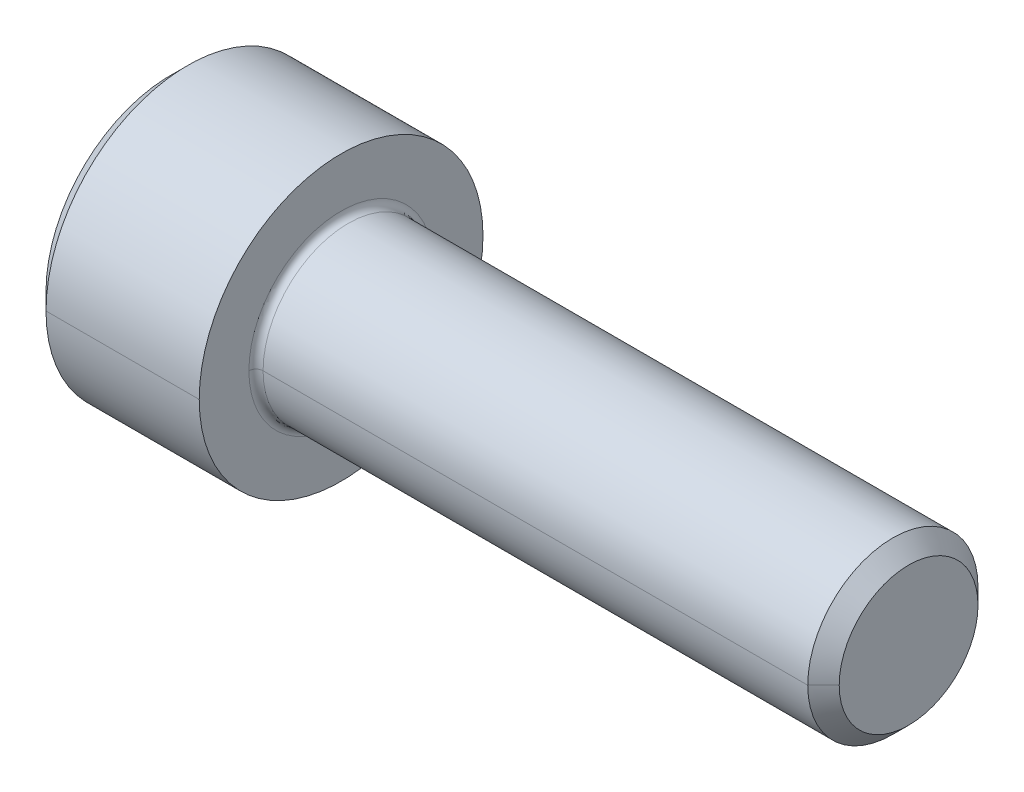
ISO-10303-21;
HEADER;
FILE_DESCRIPTION(('STEP AP214'),'2;1');
FILE_NAME('part.step','',(''),(''),'','','');
FILE_SCHEMA(('AUTOMOTIVE_DESIGN { 1 0 10303 214 1 1 1 1 }'));
ENDSEC;
DATA;
#1=APPLICATION_CONTEXT('core data for automotive mechanical design processes');
#2=APPLICATION_PROTOCOL_DEFINITION('international standard','automotive_design',2000,#1);
#3=PRODUCT_CONTEXT('',#1,'mechanical');
#4=PRODUCT('Part','Part','',(#3));
#5=PRODUCT_RELATED_PRODUCT_CATEGORY('part','',(#4));
#6=PRODUCT_DEFINITION_FORMATION('','',#4);
#7=PRODUCT_DEFINITION_CONTEXT('part definition',#1,'design');
#8=PRODUCT_DEFINITION('design','',#6,#7);
#9=PRODUCT_DEFINITION_SHAPE('','',#8);
#10=(LENGTH_UNIT() NAMED_UNIT(*) SI_UNIT(.MILLI.,.METRE.));
#11=(NAMED_UNIT(*) PLANE_ANGLE_UNIT() SI_UNIT($,.RADIAN.));
#12=(NAMED_UNIT(*) SI_UNIT($,.STERADIAN.) SOLID_ANGLE_UNIT());
#13=UNCERTAINTY_MEASURE_WITH_UNIT(LENGTH_MEASURE(1.E-05),#10,'distance_accuracy_value','');
#14=(GEOMETRIC_REPRESENTATION_CONTEXT(3) GLOBAL_UNCERTAINTY_ASSIGNED_CONTEXT((#13)) GLOBAL_UNIT_ASSIGNED_CONTEXT((#10,
#11,#12)) REPRESENTATION_CONTEXT('',''));
#15=CARTESIAN_POINT('',(0.,0.,0.));
#16=DIRECTION('',(0.,0.,1.));
#17=DIRECTION('',(1.,0.,0.));
#18=AXIS2_PLACEMENT_3D('',#15,#16,#17);
#19=CARTESIAN_POINT('',(3.,0.,0.));
#20=DIRECTION('',(-1.,0.,0.));
#21=DIRECTION('',(0.,0.,1.));
#22=AXIS2_PLACEMENT_3D('',#19,#20,#21);
#23=CONICAL_SURFACE('',#22,2.542,1.0471975511966);
#24=DIRECTION('',(-0.5,0.,-0.866025403784437));
#25=VECTOR('',#24,1.);
#26=CARTESIAN_POINT('',(3.,0.,-2.542));
#27=LINE('',#26,#25);
#28=CARTESIAN_POINT('',(4.46762438428004,0.,0.));
#29=VERTEX_POINT('',#28);
#30=CARTESIAN_POINT('',(3.,0.,-2.542));
#31=VERTEX_POINT('',#30);
#32=EDGE_CURVE('E388',#29,#31,#27,.T.);
#33=ORIENTED_EDGE('',*,*,#32,.F.);
#34=DIRECTION('',(-0.5,0.,0.866025403784437));
#35=VECTOR('',#34,1.);
#36=CARTESIAN_POINT('',(3.,0.,2.542));
#37=LINE('',#36,#35);
#38=CARTESIAN_POINT('',(3.,0.,2.542));
#39=VERTEX_POINT('',#38);
#40=EDGE_CURVE('E385',#29,#39,#37,.T.);
#41=ORIENTED_EDGE('',*,*,#40,.T.);
#42=CARTESIAN_POINT('',(3.,0.,0.));
#43=DIRECTION('',(-1.,0.,0.));
#44=DIRECTION('',(0.,0.,1.));
#45=AXIS2_PLACEMENT_3D('',#42,#43,#44);
#46=CIRCLE('',#45,2.542);
#47=CARTESIAN_POINT('',(3.,2.20143657642004,1.271));
#48=VERTEX_POINT('',#47);
#49=EDGE_CURVE('E356',#39,#48,#46,.T.);
#50=ORIENTED_EDGE('',*,*,#49,.T.);
#51=CARTESIAN_POINT('',(3.,0.,0.));
#52=DIRECTION('',(-1.,0.,0.));
#53=DIRECTION('',(0.,0.,1.));
#54=AXIS2_PLACEMENT_3D('',#51,#52,#53);
#55=CIRCLE('',#54,2.542);
#56=CARTESIAN_POINT('',(3.,2.20143657642004,-1.271));
#57=VERTEX_POINT('',#56);
#58=EDGE_CURVE('E18',#48,#57,#55,.T.);
#59=ORIENTED_EDGE('',*,*,#58,.T.);
#60=CARTESIAN_POINT('',(3.,0.,0.));
#61=DIRECTION('',(-1.,0.,0.));
#62=DIRECTION('',(0.,0.,1.));
#63=AXIS2_PLACEMENT_3D('',#60,#61,#62);
#64=CIRCLE('',#63,2.542);
#65=EDGE_CURVE('E9',#57,#31,#64,.T.);
#66=ORIENTED_EDGE('',*,*,#65,.T.);
#67=EDGE_LOOP('',(#33,#41,#50,#59,#66));
#68=FACE_BOUND('',#67,.T.);
#69=ADVANCED_FACE('F14',(#68),#23,.F.);
#70=CARTESIAN_POINT('',(3.,4.40287315284008,-2.542));
#71=DIRECTION('',(1.,0.,0.));
#72=DIRECTION('',(0.,1.,0.));
#73=AXIS2_PLACEMENT_3D('',#70,#71,#72);
#74=PLANE('',#73);
#75=DIRECTION('',(0.,-0.5,-0.866025403784438));
#76=VECTOR('',#75,1.);
#77=CARTESIAN_POINT('',(3.,2.93524876856006,0.));
#78=LINE('',#77,#76);
#79=CARTESIAN_POINT('',(3.,1.46762438428002,-2.542));
#80=VERTEX_POINT('',#79);
#81=EDGE_CURVE('E42',#57,#80,#78,.T.);
#82=ORIENTED_EDGE('',*,*,#81,.T.);
#83=DIRECTION('',(0.,-1.,0.));
#84=VECTOR('',#83,1.);
#85=CARTESIAN_POINT('',(3.,1.46762438428002,-2.542));
#86=LINE('',#85,#84);
#87=EDGE_CURVE('E347',#80,#31,#86,.T.);
#88=ORIENTED_EDGE('',*,*,#87,.T.);
#89=ORIENTED_EDGE('',*,*,#65,.F.);
#90=EDGE_LOOP('',(#82,#88,#89));
#91=FACE_BOUND('',#90,.T.);
#92=ADVANCED_FACE('F471',(#91),#74,.F.);
#93=CARTESIAN_POINT('',(3.,4.40287315284008,-2.542));
#94=DIRECTION('',(1.,0.,0.));
#95=DIRECTION('',(0.,1.,0.));
#96=AXIS2_PLACEMENT_3D('',#93,#94,#95);
#97=PLANE('',#96);
#98=DIRECTION('',(0.,-0.5,0.866025403784439));
#99=VECTOR('',#98,1.);
#100=CARTESIAN_POINT('',(3.,2.93524876856006,0.));
#101=LINE('',#100,#99);
#102=CARTESIAN_POINT('',(3.,2.93524876856006,0.));
#103=VERTEX_POINT('',#102);
#104=EDGE_CURVE('E317',#103,#48,#101,.T.);
#105=ORIENTED_EDGE('',*,*,#104,.F.);
#106=DIRECTION('',(0.,-0.5,-0.866025403784438));
#107=VECTOR('',#106,1.);
#108=CARTESIAN_POINT('',(3.,2.93524876856006,0.));
#109=LINE('',#108,#107);
#110=EDGE_CURVE('E353',#103,#57,#109,.T.);
#111=ORIENTED_EDGE('',*,*,#110,.T.);
#112=ORIENTED_EDGE('',*,*,#58,.F.);
#113=EDGE_LOOP('',(#105,#111,#112));
#114=FACE_BOUND('',#113,.T.);
#115=ADVANCED_FACE('F16',(#114),#97,.F.);
#116=CARTESIAN_POINT('',(3.,4.40287315284008,-2.542));
#117=DIRECTION('',(1.,0.,0.));
#118=DIRECTION('',(0.,1.,0.));
#119=AXIS2_PLACEMENT_3D('',#116,#117,#118);
#120=PLANE('',#119);
#121=DIRECTION('',(0.,1.,0.));
#122=VECTOR('',#121,1.);
#123=CARTESIAN_POINT('',(3.,-1.46762438428003,2.542));
#124=LINE('',#123,#122);
#125=CARTESIAN_POINT('',(3.,1.46762438428003,2.542));
#126=VERTEX_POINT('',#125);
#127=EDGE_CURVE('E328',#39,#126,#124,.T.);
#128=ORIENTED_EDGE('',*,*,#127,.T.);
#129=DIRECTION('',(0.,-0.5,0.866025403784439));
#130=VECTOR('',#129,1.);
#131=CARTESIAN_POINT('',(3.,2.93524876856006,0.));
#132=LINE('',#131,#130);
#133=EDGE_CURVE('E321',#48,#126,#132,.T.);
#134=ORIENTED_EDGE('',*,*,#133,.F.);
#135=ORIENTED_EDGE('',*,*,#49,.F.);
#136=EDGE_LOOP('',(#128,#134,#135));
#137=FACE_BOUND('',#136,.T.);
#138=ADVANCED_FACE('F426',(#137),#120,.F.);
#139=CARTESIAN_POINT('',(3.,4.40287315284008,-2.542));
#140=DIRECTION('',(1.,0.,0.));
#141=DIRECTION('',(0.,1.,0.));
#142=AXIS2_PLACEMENT_3D('',#139,#140,#141);
#143=PLANE('',#142);
#144=DIRECTION('',(0.,-0.5,-0.866025403784438));
#145=VECTOR('',#144,1.);
#146=CARTESIAN_POINT('',(3.,-1.46762438428003,2.542));
#147=LINE('',#146,#145);
#148=CARTESIAN_POINT('',(3.,-1.46762438428003,2.542));
#149=VERTEX_POINT('',#148);
#150=CARTESIAN_POINT('',(3.,-2.20143657642005,1.271));
#151=VERTEX_POINT('',#150);
#152=EDGE_CURVE('E232',#149,#151,#147,.T.);
#153=ORIENTED_EDGE('',*,*,#152,.F.);
#154=DIRECTION('',(0.,1.,0.));
#155=VECTOR('',#154,1.);
#156=CARTESIAN_POINT('',(3.,-1.46762438428003,2.542));
#157=LINE('',#156,#155);
#158=EDGE_CURVE('E331',#149,#39,#157,.T.);
#159=ORIENTED_EDGE('',*,*,#158,.T.);
#160=CARTESIAN_POINT('',(3.,0.,0.));
#161=DIRECTION('',(-1.,0.,0.));
#162=DIRECTION('',(0.,0.,1.));
#163=AXIS2_PLACEMENT_3D('',#160,#161,#162);
#164=CIRCLE('',#163,2.542);
#165=EDGE_CURVE('E200',#151,#39,#164,.T.);
#166=ORIENTED_EDGE('',*,*,#165,.F.);
#167=EDGE_LOOP('',(#153,#159,#166));
#168=FACE_BOUND('',#167,.T.);
#169=ADVANCED_FACE('F420',(#168),#143,.F.);
#170=CARTESIAN_POINT('',(3.,4.40287315284008,-2.542));
#171=DIRECTION('',(1.,0.,0.));
#172=DIRECTION('',(0.,1.,0.));
#173=AXIS2_PLACEMENT_3D('',#170,#171,#172);
#174=PLANE('',#173);
#175=DIRECTION('',(0.,0.5,-0.86602540378444));
#176=VECTOR('',#175,1.);
#177=CARTESIAN_POINT('',(3.,-2.93524876856006,0.));
#178=LINE('',#177,#176);
#179=CARTESIAN_POINT('',(3.,-2.93524876856006,0.));
#180=VERTEX_POINT('',#179);
#181=CARTESIAN_POINT('',(3.,-2.20143657642005,-1.271));
#182=VERTEX_POINT('',#181);
#183=EDGE_CURVE('E306',#180,#182,#178,.T.);
#184=ORIENTED_EDGE('',*,*,#183,.F.);
#185=DIRECTION('',(0.,-0.5,-0.866025403784438));
#186=VECTOR('',#185,1.);
#187=CARTESIAN_POINT('',(3.,-1.46762438428003,2.542));
#188=LINE('',#187,#186);
#189=EDGE_CURVE('E236',#151,#180,#188,.T.);
#190=ORIENTED_EDGE('',*,*,#189,.F.);
#191=CARTESIAN_POINT('',(3.,0.,0.));
#192=DIRECTION('',(-1.,0.,0.));
#193=DIRECTION('',(0.,0.,1.));
#194=AXIS2_PLACEMENT_3D('',#191,#192,#193);
#195=CIRCLE('',#194,2.542);
#196=EDGE_CURVE('E209',#182,#151,#195,.T.);
#197=ORIENTED_EDGE('',*,*,#196,.F.);
#198=EDGE_LOOP('',(#184,#190,#197));
#199=FACE_BOUND('',#198,.T.);
#200=ADVANCED_FACE('F412',(#199),#174,.F.);
#201=CARTESIAN_POINT('',(3.,4.40287315284008,-2.542));
#202=DIRECTION('',(1.,0.,0.));
#203=DIRECTION('',(0.,1.,0.));
#204=AXIS2_PLACEMENT_3D('',#201,#202,#203);
#205=PLANE('',#204);
#206=DIRECTION('',(0.,-1.,0.));
#207=VECTOR('',#206,1.);
#208=CARTESIAN_POINT('',(3.,1.46762438428002,-2.542));
#209=LINE('',#208,#207);
#210=CARTESIAN_POINT('',(3.,-1.46762438428004,-2.542));
#211=VERTEX_POINT('',#210);
#212=EDGE_CURVE('E247',#31,#211,#209,.T.);
#213=ORIENTED_EDGE('',*,*,#212,.T.);
#214=DIRECTION('',(0.,0.5,-0.86602540378444));
#215=VECTOR('',#214,1.);
#216=CARTESIAN_POINT('',(3.,-2.93524876856006,0.));
#217=LINE('',#216,#215);
#218=EDGE_CURVE('E248',#182,#211,#217,.T.);
#219=ORIENTED_EDGE('',*,*,#218,.F.);
#220=CARTESIAN_POINT('',(3.,0.,0.));
#221=DIRECTION('',(-1.,0.,0.));
#222=DIRECTION('',(0.,0.,1.));
#223=AXIS2_PLACEMENT_3D('',#220,#221,#222);
#224=CIRCLE('',#223,2.542);
#225=EDGE_CURVE('E213',#31,#182,#224,.T.);
#226=ORIENTED_EDGE('',*,*,#225,.F.);
#227=EDGE_LOOP('',(#213,#219,#226));
#228=FACE_BOUND('',#227,.T.);
#229=ADVANCED_FACE('F406',(#228),#205,.F.);
#230=CARTESIAN_POINT('',(3.,2.93524876856006,0.));
#231=DIRECTION('',(0.,0.866025403784438,-0.5));
#232=DIRECTION('',(-1.,0.,0.));
#233=AXIS2_PLACEMENT_3D('',#230,#231,#232);
#234=PLANE('',#233);
#235=DIRECTION('',(0.,-0.5,-0.866025403784438));
#236=VECTOR('',#235,1.);
#237=CARTESIAN_POINT('',(0.,2.93524876856006,0.));
#238=LINE('',#237,#236);
#239=CARTESIAN_POINT('',(0.,2.93524876856006,0.));
#240=VERTEX_POINT('',#239);
#241=CARTESIAN_POINT('',(0.,1.46762438428002,-2.542));
#242=VERTEX_POINT('',#241);
#243=EDGE_CURVE('E223',#240,#242,#238,.T.);
#244=ORIENTED_EDGE('',*,*,#243,.T.);
#245=DIRECTION('',(-1.,0.,0.));
#246=VECTOR('',#245,1.);
#247=CARTESIAN_POINT('',(3.,1.46762438428002,-2.542));
#248=LINE('',#247,#246);
#249=EDGE_CURVE('E348',#80,#242,#248,.T.);
#250=ORIENTED_EDGE('',*,*,#249,.F.);
#251=ORIENTED_EDGE('',*,*,#81,.F.);
#252=ORIENTED_EDGE('',*,*,#110,.F.);
#253=DIRECTION('',(-1.,0.,0.));
#254=VECTOR('',#253,1.);
#255=CARTESIAN_POINT('',(3.,2.93524876856006,0.));
#256=LINE('',#255,#254);
#257=EDGE_CURVE('E207',#103,#240,#256,.T.);
#258=ORIENTED_EDGE('',*,*,#257,.T.);
#259=EDGE_LOOP('',(#244,#250,#251,#252,#258));
#260=FACE_BOUND('',#259,.T.);
#261=ADVANCED_FACE('F371',(#260),#234,.F.);
#262=CARTESIAN_POINT('',(3.,1.46762438428002,-2.542));
#263=DIRECTION('',(0.,0.,-1.));
#264=DIRECTION('',(0.,-1.,0.));
#265=AXIS2_PLACEMENT_3D('',#262,#263,#264);
#266=PLANE('',#265);
#267=DIRECTION('',(0.,-1.,0.));
#268=VECTOR('',#267,1.);
#269=CARTESIAN_POINT('',(0.,1.46762438428002,-2.542));
#270=LINE('',#269,#268);
#271=CARTESIAN_POINT('',(0.,-1.46762438428004,-2.542));
#272=VERTEX_POINT('',#271);
#273=EDGE_CURVE('E228',#242,#272,#270,.T.);
#274=ORIENTED_EDGE('',*,*,#273,.T.);
#275=DIRECTION('',(-1.,0.,0.));
#276=VECTOR('',#275,1.);
#277=CARTESIAN_POINT('',(3.,-1.46762438428004,-2.542));
#278=LINE('',#277,#276);
#279=EDGE_CURVE('E244',#211,#272,#278,.T.);
#280=ORIENTED_EDGE('',*,*,#279,.F.);
#281=ORIENTED_EDGE('',*,*,#212,.F.);
#282=ORIENTED_EDGE('',*,*,#87,.F.);
#283=ORIENTED_EDGE('',*,*,#249,.T.);
#284=EDGE_LOOP('',(#274,#280,#281,#282,#283));
#285=FACE_BOUND('',#284,.T.);
#286=ADVANCED_FACE('F377',(#285),#266,.F.);
#287=CARTESIAN_POINT('',(3.,-2.93524876856006,0.));
#288=DIRECTION('',(0.,0.86602540378444,0.5));
#289=DIRECTION('',(1.,0.,0.));
#290=AXIS2_PLACEMENT_3D('',#287,#288,#289);
#291=PLANE('',#290);
#292=DIRECTION('',(0.,0.5,-0.86602540378444));
#293=VECTOR('',#292,1.);
#294=CARTESIAN_POINT('',(0.,-2.93524876856006,0.));
#295=LINE('',#294,#293);
#296=CARTESIAN_POINT('',(0.,-2.93524876856006,0.));
#297=VERTEX_POINT('',#296);
#298=EDGE_CURVE('E299',#297,#272,#295,.T.);
#299=ORIENTED_EDGE('',*,*,#298,.F.);
#300=DIRECTION('',(-1.,0.,0.));
#301=VECTOR('',#300,1.);
#302=CARTESIAN_POINT('',(3.,-2.93524876856006,0.));
#303=LINE('',#302,#301);
#304=EDGE_CURVE('E310',#180,#297,#303,.T.);
#305=ORIENTED_EDGE('',*,*,#304,.F.);
#306=ORIENTED_EDGE('',*,*,#183,.T.);
#307=ORIENTED_EDGE('',*,*,#218,.T.);
#308=ORIENTED_EDGE('',*,*,#279,.T.);
#309=EDGE_LOOP('',(#299,#305,#306,#307,#308));
#310=FACE_BOUND('',#309,.T.);
#311=ADVANCED_FACE('F410',(#310),#291,.T.);
#312=CARTESIAN_POINT('',(3.,-1.46762438428003,2.542));
#313=DIRECTION('',(0.,0.866025403784438,-0.5));
#314=DIRECTION('',(-1.,0.,0.));
#315=AXIS2_PLACEMENT_3D('',#312,#313,#314);
#316=PLANE('',#315);
#317=DIRECTION('',(0.,-0.5,-0.866025403784438));
#318=VECTOR('',#317,1.);
#319=CARTESIAN_POINT('',(0.,-1.46762438428003,2.542));
#320=LINE('',#319,#318);
#321=CARTESIAN_POINT('',(0.,-1.46762438428003,2.542));
#322=VERTEX_POINT('',#321);
#323=EDGE_CURVE('E295',#322,#297,#320,.T.);
#324=ORIENTED_EDGE('',*,*,#323,.F.);
#325=DIRECTION('',(-1.,0.,0.));
#326=VECTOR('',#325,1.);
#327=CARTESIAN_POINT('',(3.,-1.46762438428003,2.542));
#328=LINE('',#327,#326);
#329=EDGE_CURVE('E237',#149,#322,#328,.T.);
#330=ORIENTED_EDGE('',*,*,#329,.F.);
#331=ORIENTED_EDGE('',*,*,#152,.T.);
#332=ORIENTED_EDGE('',*,*,#189,.T.);
#333=ORIENTED_EDGE('',*,*,#304,.T.);
#334=EDGE_LOOP('',(#324,#330,#331,#332,#333));
#335=FACE_BOUND('',#334,.T.);
#336=ADVANCED_FACE('F417',(#335),#316,.T.);
#337=CARTESIAN_POINT('',(3.,-1.46762438428003,2.542));
#338=DIRECTION('',(0.,0.,1.));
#339=DIRECTION('',(0.,-1.,0.));
#340=AXIS2_PLACEMENT_3D('',#337,#338,#339);
#341=PLANE('',#340);
#342=DIRECTION('',(0.,1.,0.));
#343=VECTOR('',#342,1.);
#344=CARTESIAN_POINT('',(0.,-1.46762438428003,2.542));
#345=LINE('',#344,#343);
#346=CARTESIAN_POINT('',(0.,1.46762438428003,2.542));
#347=VERTEX_POINT('',#346);
#348=EDGE_CURVE('E291',#322,#347,#345,.T.);
#349=ORIENTED_EDGE('',*,*,#348,.T.);
#350=DIRECTION('',(-1.,0.,0.));
#351=VECTOR('',#350,1.);
#352=CARTESIAN_POINT('',(3.,1.46762438428003,2.542));
#353=LINE('',#352,#351);
#354=EDGE_CURVE('E325',#126,#347,#353,.T.);
#355=ORIENTED_EDGE('',*,*,#354,.F.);
#356=ORIENTED_EDGE('',*,*,#127,.F.);
#357=ORIENTED_EDGE('',*,*,#158,.F.);
#358=ORIENTED_EDGE('',*,*,#329,.T.);
#359=EDGE_LOOP('',(#349,#355,#356,#357,#358));
#360=FACE_BOUND('',#359,.T.);
#361=ADVANCED_FACE('F424',(#360),#341,.F.);
#362=CARTESIAN_POINT('',(3.,2.93524876856006,0.));
#363=DIRECTION('',(0.,-0.866025403784439,-0.5));
#364=DIRECTION('',(0.,0.5,-0.866025403784439));
#365=AXIS2_PLACEMENT_3D('',#362,#363,#364);
#366=PLANE('',#365);
#367=DIRECTION('',(0.,-0.5,0.866025403784439));
#368=VECTOR('',#367,1.);
#369=CARTESIAN_POINT('',(0.,2.93524876856006,0.));
#370=LINE('',#369,#368);
#371=EDGE_CURVE('E287',#240,#347,#370,.T.);
#372=ORIENTED_EDGE('',*,*,#371,.F.);
#373=ORIENTED_EDGE('',*,*,#257,.F.);
#374=ORIENTED_EDGE('',*,*,#104,.T.);
#375=ORIENTED_EDGE('',*,*,#133,.T.);
#376=ORIENTED_EDGE('',*,*,#354,.T.);
#377=EDGE_LOOP('',(#372,#373,#374,#375,#376));
#378=FACE_BOUND('',#377,.T.);
#379=ADVANCED_FACE('F429',(#378),#366,.T.);
#380=CARTESIAN_POINT('',(6.25,0.,0.));
#381=DIRECTION('',(1.,0.,0.));
#382=DIRECTION('',(0.,0.,-1.));
#383=AXIS2_PLACEMENT_3D('',#380,#381,#382);
#384=TOROIDAL_SURFACE('',#383,3.25,0.25);
#385=CARTESIAN_POINT('',(6.25,0.,3.25));
#386=DIRECTION('',(0.,1.,0.));
#387=DIRECTION('',(0.,0.,1.));
#388=AXIS2_PLACEMENT_3D('',#385,#386,#387);
#389=CIRCLE('',#388,0.25);
#390=CARTESIAN_POINT('',(6.25,0.,3.));
#391=VERTEX_POINT('',#390);
#392=CARTESIAN_POINT('',(6.,0.,3.25));
#393=VERTEX_POINT('',#392);
#394=EDGE_CURVE('E175',#391,#393,#389,.T.);
#395=ORIENTED_EDGE('',*,*,#394,.F.);
#396=CARTESIAN_POINT('',(6.25,0.,0.));
#397=DIRECTION('',(1.,0.,0.));
#398=DIRECTION('',(0.,0.,-1.));
#399=AXIS2_PLACEMENT_3D('',#396,#397,#398);
#400=CIRCLE('',#399,3.);
#401=CARTESIAN_POINT('',(6.25,0.,-3.));
#402=VERTEX_POINT('',#401);
#403=EDGE_CURVE('E268',#402,#391,#400,.T.);
#404=ORIENTED_EDGE('',*,*,#403,.F.);
#405=CARTESIAN_POINT('',(6.25,0.,-3.25));
#406=DIRECTION('',(0.,-1.,0.));
#407=DIRECTION('',(0.,0.,-1.));
#408=AXIS2_PLACEMENT_3D('',#405,#406,#407);
#409=CIRCLE('',#408,0.25);
#410=CARTESIAN_POINT('',(6.,0.,-3.25));
#411=VERTEX_POINT('',#410);
#412=EDGE_CURVE('E178',#402,#411,#409,.T.);
#413=ORIENTED_EDGE('',*,*,#412,.T.);
#414=CARTESIAN_POINT('',(6.,0.,0.));
#415=DIRECTION('',(-1.,0.,0.));
#416=DIRECTION('',(0.,0.,-1.));
#417=AXIS2_PLACEMENT_3D('',#414,#415,#416);
#418=CIRCLE('',#417,3.25);
#419=EDGE_CURVE('E171',#393,#411,#418,.T.);
#420=ORIENTED_EDGE('',*,*,#419,.F.);
#421=EDGE_LOOP('',(#395,#404,#413,#420));
#422=FACE_BOUND('',#421,.T.);
#423=ADVANCED_FACE('F173',(#422),#384,.F.);
#424=CARTESIAN_POINT('',(0.,0.,0.));
#425=DIRECTION('',(1.,0.,0.));
#426=DIRECTION('',(0.,0.,-1.));
#427=AXIS2_PLACEMENT_3D('',#424,#425,#426);
#428=CONICAL_SURFACE('',#427,4.4,0.785398163397446);
#429=DIRECTION('',(0.707106781186549,0.,0.707106781186546));
#430=VECTOR('',#429,1.);
#431=CARTESIAN_POINT('',(0.,0.,4.4));
#432=LINE('',#431,#430);
#433=CARTESIAN_POINT('',(0.,0.,4.4));
#434=VERTEX_POINT('',#433);
#435=CARTESIAN_POINT('',(0.6,0.,5.));
#436=VERTEX_POINT('',#435);
#437=EDGE_CURVE('E204',#434,#436,#432,.T.);
#438=ORIENTED_EDGE('',*,*,#437,.F.);
#439=CARTESIAN_POINT('',(0.,0.,0.));
#440=DIRECTION('',(-1.,0.,0.));
#441=DIRECTION('',(0.,0.,1.));
#442=AXIS2_PLACEMENT_3D('',#439,#440,#441);
#443=CIRCLE('',#442,4.4);
#444=CARTESIAN_POINT('',(0.,0.,-4.4));
#445=VERTEX_POINT('',#444);
#446=EDGE_CURVE('E218',#445,#434,#443,.T.);
#447=ORIENTED_EDGE('',*,*,#446,.F.);
#448=DIRECTION('',(0.707106781186549,0.,-0.707106781186546));
#449=VECTOR('',#448,1.);
#450=CARTESIAN_POINT('',(0.,0.,-4.4));
#451=LINE('',#450,#449);
#452=CARTESIAN_POINT('',(0.6,0.,-5.));
#453=VERTEX_POINT('',#452);
#454=EDGE_CURVE('E238',#445,#453,#451,.T.);
#455=ORIENTED_EDGE('',*,*,#454,.T.);
#456=CARTESIAN_POINT('',(0.6,0.,0.));
#457=DIRECTION('',(-1.,0.,0.));
#458=DIRECTION('',(0.,0.,1.));
#459=AXIS2_PLACEMENT_3D('',#456,#457,#458);
#460=CIRCLE('',#459,5.);
#461=EDGE_CURVE('E182',#453,#436,#460,.T.);
#462=ORIENTED_EDGE('',*,*,#461,.T.);
#463=EDGE_LOOP('',(#438,#447,#455,#462));
#464=FACE_BOUND('',#463,.T.);
#465=ADVANCED_FACE('F443',(#464),#428,.T.);
#466=CARTESIAN_POINT('',(-31.75,0.,0.));
#467=DIRECTION('',(-1.,0.,0.));
#468=DIRECTION('',(0.,0.,1.));
#469=AXIS2_PLACEMENT_3D('',#466,#467,#468);
#470=CYLINDRICAL_SURFACE('',#469,5.);
#471=DIRECTION('',(-1.,0.,0.));
#472=VECTOR('',#471,1.);
#473=CARTESIAN_POINT('',(-31.75,0.,-5.));
#474=LINE('',#473,#472);
#475=CARTESIAN_POINT('',(6.,0.,-5.));
#476=VERTEX_POINT('',#475);
#477=EDGE_CURVE('E255',#476,#453,#474,.T.);
#478=ORIENTED_EDGE('',*,*,#477,.F.);
#479=CARTESIAN_POINT('',(6.,0.,0.));
#480=DIRECTION('',(-1.,0.,0.));
#481=DIRECTION('',(0.,0.,1.));
#482=AXIS2_PLACEMENT_3D('',#479,#480,#481);
#483=CIRCLE('',#482,5.);
#484=CARTESIAN_POINT('',(6.,0.,5.));
#485=VERTEX_POINT('',#484);
#486=EDGE_CURVE('E183',#476,#485,#483,.T.);
#487=ORIENTED_EDGE('',*,*,#486,.T.);
#488=DIRECTION('',(-1.,0.,0.));
#489=VECTOR('',#488,1.);
#490=CARTESIAN_POINT('',(-31.75,0.,5.));
#491=LINE('',#490,#489);
#492=EDGE_CURVE('E259',#485,#436,#491,.T.);
#493=ORIENTED_EDGE('',*,*,#492,.T.);
#494=ORIENTED_EDGE('',*,*,#461,.F.);
#495=EDGE_LOOP('',(#478,#487,#493,#494));
#496=FACE_BOUND('',#495,.T.);
#497=ADVANCED_FACE('F454',(#496),#470,.T.);
#498=CARTESIAN_POINT('',(6.,5.,0.));
#499=DIRECTION('',(1.,0.,0.));
#500=DIRECTION('',(0.,1.,0.));
#501=AXIS2_PLACEMENT_3D('',#498,#499,#500);
#502=PLANE('',#501);
#503=CARTESIAN_POINT('',(6.,0.,0.));
#504=DIRECTION('',(-1.,0.,0.));
#505=DIRECTION('',(0.,0.,-1.));
#506=AXIS2_PLACEMENT_3D('',#503,#504,#505);
#507=CIRCLE('',#506,3.25);
#508=EDGE_CURVE('E185',#411,#393,#507,.T.);
#509=ORIENTED_EDGE('',*,*,#508,.T.);
#510=ORIENTED_EDGE('',*,*,#419,.T.);
#511=EDGE_LOOP('',(#509,#510));
#512=FACE_BOUND('',#511,.T.);
#513=CARTESIAN_POINT('',(6.,0.,0.));
#514=DIRECTION('',(-1.,0.,0.));
#515=DIRECTION('',(0.,0.,1.));
#516=AXIS2_PLACEMENT_3D('',#513,#514,#515);
#517=CIRCLE('',#516,5.);
#518=EDGE_CURVE('E242',#485,#476,#517,.T.);
#519=ORIENTED_EDGE('',*,*,#518,.F.);
#520=ORIENTED_EDGE('',*,*,#486,.F.);
#521=EDGE_LOOP('',(#519,#520));
#522=FACE_BOUND('',#521,.T.);
#523=ADVANCED_FACE('F186',(#512,#522),#502,.T.);
#524=CARTESIAN_POINT('',(-31.75,0.,0.));
#525=DIRECTION('',(-1.,0.,0.));
#526=DIRECTION('',(0.,0.,1.));
#527=AXIS2_PLACEMENT_3D('',#524,#525,#526);
#528=CYLINDRICAL_SURFACE('',#527,3.);
#529=DIRECTION('',(-1.,0.,0.));
#530=VECTOR('',#529,1.);
#531=CARTESIAN_POINT('',(-31.75,0.,-3.));
#532=LINE('',#531,#530);
#533=CARTESIAN_POINT('',(25.4455,0.,-2.99999999999996));
#534=VERTEX_POINT('',#533);
#535=EDGE_CURVE('E264',#534,#402,#532,.T.);
#536=ORIENTED_EDGE('',*,*,#535,.F.);
#537=CARTESIAN_POINT('',(25.4455,0.,0.));
#538=DIRECTION('',(-1.,0.,0.));
#539=DIRECTION('',(0.,0.,1.));
#540=AXIS2_PLACEMENT_3D('',#537,#538,#539);
#541=CIRCLE('',#540,2.99999999999996);
#542=CARTESIAN_POINT('',(25.4455,0.,2.99999999999996));
#543=VERTEX_POINT('',#542);
#544=EDGE_CURVE('E284',#534,#543,#541,.T.);
#545=ORIENTED_EDGE('',*,*,#544,.T.);
#546=DIRECTION('',(-1.,0.,0.));
#547=VECTOR('',#546,1.);
#548=CARTESIAN_POINT('',(-31.75,0.,3.));
#549=LINE('',#548,#547);
#550=EDGE_CURVE('E272',#543,#391,#549,.T.);
#551=ORIENTED_EDGE('',*,*,#550,.T.);
#552=CARTESIAN_POINT('',(6.25,0.,0.));
#553=DIRECTION('',(1.,0.,0.));
#554=DIRECTION('',(0.,0.,-1.));
#555=AXIS2_PLACEMENT_3D('',#552,#553,#554);
#556=CIRCLE('',#555,3.);
#557=EDGE_CURVE('E193',#391,#402,#556,.T.);
#558=ORIENTED_EDGE('',*,*,#557,.T.);
#559=EDGE_LOOP('',(#536,#545,#551,#558));
#560=FACE_BOUND('',#559,.T.);
#561=ADVANCED_FACE('F456',(#560),#528,.T.);
#562=CARTESIAN_POINT('',(26.,0.,0.));
#563=DIRECTION('',(-1.,0.,0.));
#564=DIRECTION('',(0.,0.,1.));
#565=AXIS2_PLACEMENT_3D('',#562,#563,#564);
#566=CONICAL_SURFACE('',#565,2.4455,0.785398163397383);
#567=DIRECTION('',(-0.707106781186594,0.,-0.707106781186501));
#568=VECTOR('',#567,1.);
#569=CARTESIAN_POINT('',(26.,0.,-2.4455));
#570=LINE('',#569,#568);
#571=CARTESIAN_POINT('',(26.,0.,-2.4455));
#572=VERTEX_POINT('',#571);
#573=EDGE_CURVE('E219',#572,#534,#570,.T.);
#574=ORIENTED_EDGE('',*,*,#573,.F.);
#575=CARTESIAN_POINT('',(26.,0.,0.));
#576=DIRECTION('',(-1.,0.,0.));
#577=DIRECTION('',(0.,0.,1.));
#578=AXIS2_PLACEMENT_3D('',#575,#576,#577);
#579=CIRCLE('',#578,2.4455);
#580=CARTESIAN_POINT('',(26.,0.,2.4455));
#581=VERTEX_POINT('',#580);
#582=EDGE_CURVE('E227',#572,#581,#579,.T.);
#583=ORIENTED_EDGE('',*,*,#582,.T.);
#584=DIRECTION('',(-0.707106781186594,0.,0.707106781186501));
#585=VECTOR('',#584,1.);
#586=CARTESIAN_POINT('',(26.,0.,2.4455));
#587=LINE('',#586,#585);
#588=EDGE_CURVE('E214',#581,#543,#587,.T.);
#589=ORIENTED_EDGE('',*,*,#588,.T.);
#590=ORIENTED_EDGE('',*,*,#544,.F.);
#591=EDGE_LOOP('',(#574,#583,#589,#590));
#592=FACE_BOUND('',#591,.T.);
#593=ADVANCED_FACE('F464',(#592),#566,.T.);
#594=CARTESIAN_POINT('',(26.,2.4455,0.));
#595=DIRECTION('',(1.,0.,0.));
#596=DIRECTION('',(0.,1.,0.));
#597=AXIS2_PLACEMENT_3D('',#594,#595,#596);
#598=PLANE('',#597);
#599=CARTESIAN_POINT('',(26.,0.,0.));
#600=DIRECTION('',(-1.,0.,0.));
#601=DIRECTION('',(0.,0.,1.));
#602=AXIS2_PLACEMENT_3D('',#599,#600,#601);
#603=CIRCLE('',#602,2.4455);
#604=EDGE_CURVE('E275',#581,#572,#603,.T.);
#605=ORIENTED_EDGE('',*,*,#604,.F.);
#606=ORIENTED_EDGE('',*,*,#582,.F.);
#607=EDGE_LOOP('',(#605,#606));
#608=FACE_BOUND('',#607,.T.);
#609=ADVANCED_FACE('F436',(#608),#598,.T.);
#610=CARTESIAN_POINT('',(0.,0.,0.));
#611=DIRECTION('',(-1.,0.,0.));
#612=DIRECTION('',(0.,0.,1.));
#613=AXIS2_PLACEMENT_3D('',#610,#611,#612);
#614=PLANE('',#613);
#615=ORIENTED_EDGE('',*,*,#371,.T.);
#616=ORIENTED_EDGE('',*,*,#348,.F.);
#617=ORIENTED_EDGE('',*,*,#323,.T.);
#618=ORIENTED_EDGE('',*,*,#298,.T.);
#619=ORIENTED_EDGE('',*,*,#273,.F.);
#620=ORIENTED_EDGE('',*,*,#243,.F.);
#621=EDGE_LOOP('',(#615,#616,#617,#618,#619,#620));
#622=FACE_BOUND('',#621,.T.);
#623=ORIENTED_EDGE('',*,*,#446,.T.);
#624=CARTESIAN_POINT('',(0.,0.,0.));
#625=DIRECTION('',(-1.,0.,0.));
#626=DIRECTION('',(0.,0.,1.));
#627=AXIS2_PLACEMENT_3D('',#624,#625,#626);
#628=CIRCLE('',#627,4.4);
#629=EDGE_CURVE('E222',#434,#445,#628,.T.);
#630=ORIENTED_EDGE('',*,*,#629,.T.);
#631=EDGE_LOOP('',(#623,#630));
#632=FACE_BOUND('',#631,.T.);
#633=ADVANCED_FACE('F431',(#622,#632),#614,.T.);
#634=CARTESIAN_POINT('',(26.,0.,0.));
#635=DIRECTION('',(-1.,0.,0.));
#636=DIRECTION('',(0.,0.,1.));
#637=AXIS2_PLACEMENT_3D('',#634,#635,#636);
#638=CONICAL_SURFACE('',#637,2.4455,0.785398163397383);
#639=ORIENTED_EDGE('',*,*,#604,.T.);
#640=ORIENTED_EDGE('',*,*,#573,.T.);
#641=CARTESIAN_POINT('',(25.4455,0.,0.));
#642=DIRECTION('',(-1.,0.,0.));
#643=DIRECTION('',(0.,0.,1.));
#644=AXIS2_PLACEMENT_3D('',#641,#642,#643);
#645=CIRCLE('',#644,2.99999999999996);
#646=EDGE_CURVE('E263',#543,#534,#645,.T.);
#647=ORIENTED_EDGE('',*,*,#646,.F.);
#648=ORIENTED_EDGE('',*,*,#588,.F.);
#649=EDGE_LOOP('',(#639,#640,#647,#648));
#650=FACE_BOUND('',#649,.T.);
#651=ADVANCED_FACE('F435',(#650),#638,.T.);
#652=CARTESIAN_POINT('',(-31.75,0.,0.));
#653=DIRECTION('',(-1.,0.,0.));
#654=DIRECTION('',(0.,0.,1.));
#655=AXIS2_PLACEMENT_3D('',#652,#653,#654);
#656=CYLINDRICAL_SURFACE('',#655,3.);
#657=ORIENTED_EDGE('',*,*,#646,.T.);
#658=ORIENTED_EDGE('',*,*,#535,.T.);
#659=ORIENTED_EDGE('',*,*,#403,.T.);
#660=ORIENTED_EDGE('',*,*,#550,.F.);
#661=EDGE_LOOP('',(#657,#658,#659,#660));
#662=FACE_BOUND('',#661,.T.);
#663=ADVANCED_FACE('F499',(#662),#656,.T.);
#664=CARTESIAN_POINT('',(-31.75,0.,0.));
#665=DIRECTION('',(-1.,0.,0.));
#666=DIRECTION('',(0.,0.,1.));
#667=AXIS2_PLACEMENT_3D('',#664,#665,#666);
#668=CYLINDRICAL_SURFACE('',#667,5.);
#669=ORIENTED_EDGE('',*,*,#518,.T.);
#670=ORIENTED_EDGE('',*,*,#477,.T.);
#671=CARTESIAN_POINT('',(0.6,0.,0.));
#672=DIRECTION('',(-1.,0.,0.));
#673=DIRECTION('',(0.,0.,1.));
#674=AXIS2_PLACEMENT_3D('',#671,#672,#673);
#675=CIRCLE('',#674,5.);
#676=EDGE_CURVE('E243',#436,#453,#675,.T.);
#677=ORIENTED_EDGE('',*,*,#676,.F.);
#678=ORIENTED_EDGE('',*,*,#492,.F.);
#679=EDGE_LOOP('',(#669,#670,#677,#678));
#680=FACE_BOUND('',#679,.T.);
#681=ADVANCED_FACE('F450',(#680),#668,.T.);
#682=CARTESIAN_POINT('',(0.,0.,0.));
#683=DIRECTION('',(1.,0.,0.));
#684=DIRECTION('',(0.,0.,-1.));
#685=AXIS2_PLACEMENT_3D('',#682,#683,#684);
#686=CONICAL_SURFACE('',#685,4.4,0.785398163397446);
#687=ORIENTED_EDGE('',*,*,#629,.F.);
#688=ORIENTED_EDGE('',*,*,#437,.T.);
#689=ORIENTED_EDGE('',*,*,#676,.T.);
#690=ORIENTED_EDGE('',*,*,#454,.F.);
#691=EDGE_LOOP('',(#687,#688,#689,#690));
#692=FACE_BOUND('',#691,.T.);
#693=ADVANCED_FACE('F446',(#692),#686,.T.);
#694=CARTESIAN_POINT('',(6.25,0.,0.));
#695=DIRECTION('',(1.,0.,0.));
#696=DIRECTION('',(0.,0.,-1.));
#697=AXIS2_PLACEMENT_3D('',#694,#695,#696);
#698=TOROIDAL_SURFACE('',#697,3.25,0.25);
#699=ORIENTED_EDGE('',*,*,#557,.F.);
#700=ORIENTED_EDGE('',*,*,#394,.T.);
#701=ORIENTED_EDGE('',*,*,#508,.F.);
#702=ORIENTED_EDGE('',*,*,#412,.F.);
#703=EDGE_LOOP('',(#699,#700,#701,#702));
#704=FACE_BOUND('',#703,.T.);
#705=ADVANCED_FACE('F191',(#704),#698,.F.);
#706=CARTESIAN_POINT('',(3.,0.,0.));
#707=DIRECTION('',(-1.,0.,0.));
#708=DIRECTION('',(0.,0.,1.));
#709=AXIS2_PLACEMENT_3D('',#706,#707,#708);
#710=CONICAL_SURFACE('',#709,2.542,1.0471975511966);
#711=ORIENTED_EDGE('',*,*,#40,.F.);
#712=ORIENTED_EDGE('',*,*,#32,.T.);
#713=ORIENTED_EDGE('',*,*,#225,.T.);
#714=ORIENTED_EDGE('',*,*,#196,.T.);
#715=ORIENTED_EDGE('',*,*,#165,.T.);
#716=EDGE_LOOP('',(#711,#712,#713,#714,#715));
#717=FACE_BOUND('',#716,.T.);
#718=ADVANCED_FACE('F403',(#717),#710,.F.);
#719=CLOSED_SHELL('',(#69,#92,#115,#138,#169,#200,#229,#261,#286,#311,#336,#361,#379,#423,#465,
#497,#523,#561,#593,#609,#633,#651,#663,#681,#693,#705,#718));
#720=MANIFOLD_SOLID_BREP('B1',#719);
#721=ADVANCED_BREP_SHAPE_REPRESENTATION('',(#18,#720),#14);
#722=SHAPE_DEFINITION_REPRESENTATION(#9,#721);
ENDSEC;
END-ISO-10303-21;
